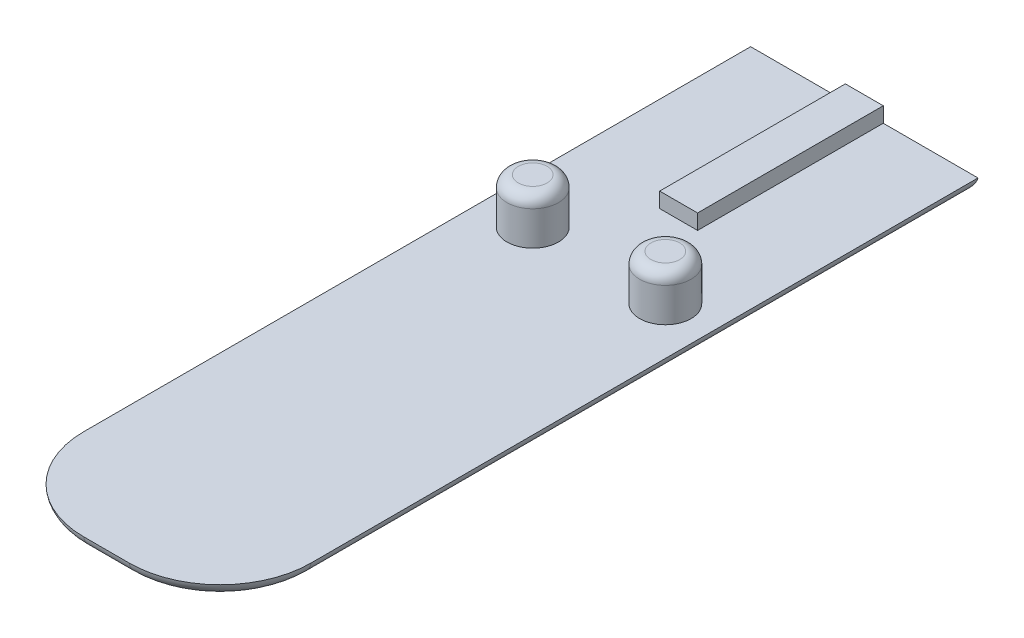
ISO-10303-21;
HEADER;
FILE_DESCRIPTION(('STEP AP214'),'2;1');
FILE_NAME('part.step','',(''),(''),'','','');
FILE_SCHEMA(('AUTOMOTIVE_DESIGN { 1 0 10303 214 1 1 1 1 }'));
ENDSEC;
DATA;
#1=APPLICATION_CONTEXT('core data for automotive mechanical design processes');
#2=APPLICATION_PROTOCOL_DEFINITION('international standard','automotive_design',2000,#1);
#3=PRODUCT_CONTEXT('',#1,'mechanical');
#4=PRODUCT('Part','Part','',(#3));
#5=PRODUCT_RELATED_PRODUCT_CATEGORY('part','',(#4));
#6=PRODUCT_DEFINITION_FORMATION('','',#4);
#7=PRODUCT_DEFINITION_CONTEXT('part definition',#1,'design');
#8=PRODUCT_DEFINITION('design','',#6,#7);
#9=PRODUCT_DEFINITION_SHAPE('','',#8);
#10=(LENGTH_UNIT() NAMED_UNIT(*) SI_UNIT(.MILLI.,.METRE.));
#11=(NAMED_UNIT(*) PLANE_ANGLE_UNIT() SI_UNIT($,.RADIAN.));
#12=(NAMED_UNIT(*) SI_UNIT($,.STERADIAN.) SOLID_ANGLE_UNIT());
#13=UNCERTAINTY_MEASURE_WITH_UNIT(LENGTH_MEASURE(1.E-05),#10,'distance_accuracy_value','');
#14=(GEOMETRIC_REPRESENTATION_CONTEXT(3) GLOBAL_UNCERTAINTY_ASSIGNED_CONTEXT((#13)) GLOBAL_UNIT_ASSIGNED_CONTEXT((#10,
#11,#12)) REPRESENTATION_CONTEXT('',''));
#15=CARTESIAN_POINT('',(0.,0.,0.));
#16=DIRECTION('',(0.,0.,1.));
#17=DIRECTION('',(1.,0.,0.));
#18=AXIS2_PLACEMENT_3D('',#15,#16,#17);
#19=CARTESIAN_POINT('',(0.,1.7,0.));
#20=DIRECTION('',(0.,1.,0.));
#21=DIRECTION('',(0.,0.,1.));
#22=AXIS2_PLACEMENT_3D('',#19,#20,#21);
#23=PLANE('',#22);
#24=CARTESIAN_POINT('',(8.75,1.7,-15.));
#25=DIRECTION('',(0.,1.,0.));
#26=DIRECTION('',(0.,0.,-1.));
#27=AXIS2_PLACEMENT_3D('',#24,#25,#26);
#28=CIRCLE('',#27,3.4);
#29=CARTESIAN_POINT('',(8.75,1.7,-18.4));
#30=VERTEX_POINT('',#29);
#31=EDGE_CURVE('E439',#30,#30,#28,.T.);
#32=ORIENTED_EDGE('',*,*,#31,.F.);
#33=EDGE_LOOP('',(#32));
#34=FACE_BOUND('',#33,.T.);
#35=CARTESIAN_POINT('',(-8.75,1.7,-15.));
#36=DIRECTION('',(0.,1.,0.));
#37=DIRECTION('',(0.,0.,1.));
#38=AXIS2_PLACEMENT_3D('',#35,#36,#37);
#39=CIRCLE('',#38,3.4);
#40=CARTESIAN_POINT('',(-8.75,1.7,-11.6));
#41=VERTEX_POINT('',#40);
#42=EDGE_CURVE('E151',#41,#41,#39,.T.);
#43=ORIENTED_EDGE('',*,*,#42,.F.);
#44=EDGE_LOOP('',(#43));
#45=FACE_BOUND('',#44,.T.);
#46=DIRECTION('',(1.,0.,0.));
#47=VECTOR('',#46,1.);
#48=CARTESIAN_POINT('',(-2.5,1.7,-25.5));
#49=LINE('',#48,#47);
#50=CARTESIAN_POINT('',(-2.5,1.7,-25.5));
#51=VERTEX_POINT('',#50);
#52=CARTESIAN_POINT('',(2.5,1.7,-25.5));
#53=VERTEX_POINT('',#52);
#54=EDGE_CURVE('E150',#51,#53,#49,.T.);
#55=ORIENTED_EDGE('',*,*,#54,.F.);
#56=DIRECTION('',(0.,0.,1.));
#57=VECTOR('',#56,1.);
#58=CARTESIAN_POINT('',(-2.5,1.7,-49.5));
#59=LINE('',#58,#57);
#60=CARTESIAN_POINT('',(-2.5,1.7,-50.));
#61=VERTEX_POINT('',#60);
#62=EDGE_CURVE('E133',#61,#51,#59,.T.);
#63=ORIENTED_EDGE('',*,*,#62,.F.);
#64=DIRECTION('',(1.,0.,0.));
#65=VECTOR('',#64,1.);
#66=CARTESIAN_POINT('',(-15.,1.7,-50.));
#67=LINE('',#66,#65);
#68=CARTESIAN_POINT('',(-15.,1.7,-50.));
#69=VERTEX_POINT('',#68);
#70=EDGE_CURVE('E159',#69,#61,#67,.T.);
#71=ORIENTED_EDGE('',*,*,#70,.F.);
#72=DIRECTION('',(0.,0.,-1.));
#73=VECTOR('',#72,1.);
#74=CARTESIAN_POINT('',(-15.,1.7,50.));
#75=LINE('',#74,#73);
#76=CARTESIAN_POINT('',(-15.,1.7,38.));
#77=VERTEX_POINT('',#76);
#78=EDGE_CURVE('E168',#77,#69,#75,.T.);
#79=ORIENTED_EDGE('',*,*,#78,.F.);
#80=CARTESIAN_POINT('',(-2.99999999999998,1.7,38.));
#81=DIRECTION('',(0.,1.,0.));
#82=DIRECTION('',(0.,0.,1.));
#83=AXIS2_PLACEMENT_3D('',#80,#81,#82);
#84=CIRCLE('',#83,12.);
#85=CARTESIAN_POINT('',(-2.99999999999998,1.7,50.));
#86=VERTEX_POINT('',#85);
#87=EDGE_CURVE('E171',#77,#86,#84,.T.);
#88=ORIENTED_EDGE('',*,*,#87,.T.);
#89=DIRECTION('',(1.,0.,0.));
#90=VECTOR('',#89,1.);
#91=CARTESIAN_POINT('',(-15.,1.7,50.));
#92=LINE('',#91,#90);
#93=CARTESIAN_POINT('',(3.,1.7,50.));
#94=VERTEX_POINT('',#93);
#95=EDGE_CURVE('E166',#86,#94,#92,.T.);
#96=ORIENTED_EDGE('',*,*,#95,.T.);
#97=CARTESIAN_POINT('',(3.,1.7,38.));
#98=DIRECTION('',(0.,1.,0.));
#99=DIRECTION('',(0.,0.,1.));
#100=AXIS2_PLACEMENT_3D('',#97,#98,#99);
#101=CIRCLE('',#100,12.);
#102=CARTESIAN_POINT('',(15.,1.7,38.));
#103=VERTEX_POINT('',#102);
#104=EDGE_CURVE('E173',#94,#103,#101,.T.);
#105=ORIENTED_EDGE('',*,*,#104,.T.);
#106=DIRECTION('',(0.,0.,-1.));
#107=VECTOR('',#106,1.);
#108=CARTESIAN_POINT('',(15.,1.7,50.));
#109=LINE('',#108,#107);
#110=CARTESIAN_POINT('',(15.,1.7,-50.));
#111=VERTEX_POINT('',#110);
#112=EDGE_CURVE('E162',#103,#111,#109,.T.);
#113=ORIENTED_EDGE('',*,*,#112,.T.);
#114=CARTESIAN_POINT('',(2.5,1.7,-50.));
#115=VERTEX_POINT('',#114);
#116=EDGE_CURVE('E163',#115,#111,#67,.T.);
#117=ORIENTED_EDGE('',*,*,#116,.F.);
#118=DIRECTION('',(0.,0.,-1.));
#119=VECTOR('',#118,1.);
#120=CARTESIAN_POINT('',(2.5,1.7,-49.5));
#121=LINE('',#120,#119);
#122=EDGE_CURVE('E153',#53,#115,#121,.T.);
#123=ORIENTED_EDGE('',*,*,#122,.F.);
#124=EDGE_LOOP('',(#55,#63,#71,#79,#88,#96,#105,#113,#117,#123));
#125=FACE_BOUND('',#124,.T.);
#126=ADVANCED_FACE('F39',(#34,#45,#125),#23,.T.);
#127=CARTESIAN_POINT('',(0.,0.,0.));
#128=DIRECTION('',(0.,1.,0.));
#129=DIRECTION('',(0.,0.,1.));
#130=AXIS2_PLACEMENT_3D('',#127,#128,#129);
#131=PLANE('',#130);
#132=DIRECTION('',(0.,0.,-1.));
#133=VECTOR('',#132,1.);
#134=CARTESIAN_POINT('',(-13.0226280066715,0.,0.));
#135=LINE('',#134,#133);
#136=CARTESIAN_POINT('',(-13.0226280066715,0.,38.));
#137=VERTEX_POINT('',#136);
#138=CARTESIAN_POINT('',(-13.0226280066715,0.,-48.0226280066715));
#139=VERTEX_POINT('',#138);
#140=EDGE_CURVE('E62',#137,#139,#135,.T.);
#141=ORIENTED_EDGE('',*,*,#140,.T.);
#142=DIRECTION('',(1.,0.,0.));
#143=VECTOR('',#142,1.);
#144=CARTESIAN_POINT('',(0.,0.,-48.0226280066715));
#145=LINE('',#144,#143);
#146=CARTESIAN_POINT('',(13.0226280066715,0.,-48.0226280066715));
#147=VERTEX_POINT('',#146);
#148=EDGE_CURVE('E184',#139,#147,#145,.T.);
#149=ORIENTED_EDGE('',*,*,#148,.T.);
#150=DIRECTION('',(0.,0.,-1.));
#151=VECTOR('',#150,1.);
#152=CARTESIAN_POINT('',(13.0226280066715,0.,0.));
#153=LINE('',#152,#151);
#154=CARTESIAN_POINT('',(13.0226280066715,0.,38.));
#155=VERTEX_POINT('',#154);
#156=EDGE_CURVE('E175',#147,#155,#153,.F.);
#157=ORIENTED_EDGE('',*,*,#156,.T.);
#158=CARTESIAN_POINT('',(3.,0.,38.));
#159=DIRECTION('',(0.,1.,0.));
#160=DIRECTION('',(0.,0.,1.));
#161=AXIS2_PLACEMENT_3D('',#158,#159,#160);
#162=CIRCLE('',#161,10.0226280066715);
#163=CARTESIAN_POINT('',(3.,0.,48.0226280066715));
#164=VERTEX_POINT('',#163);
#165=EDGE_CURVE('E177',#155,#164,#162,.F.);
#166=ORIENTED_EDGE('',*,*,#165,.T.);
#167=DIRECTION('',(1.,0.,0.));
#168=VECTOR('',#167,1.);
#169=CARTESIAN_POINT('',(0.,0.,48.0226280066715));
#170=LINE('',#169,#168);
#171=CARTESIAN_POINT('',(-2.99999999999998,0.,48.0226280066715));
#172=VERTEX_POINT('',#171);
#173=EDGE_CURVE('E179',#164,#172,#170,.F.);
#174=ORIENTED_EDGE('',*,*,#173,.T.);
#175=CARTESIAN_POINT('',(-2.99999999999998,0.,38.));
#176=DIRECTION('',(0.,1.,0.));
#177=DIRECTION('',(0.,0.,1.));
#178=AXIS2_PLACEMENT_3D('',#175,#176,#177);
#179=CIRCLE('',#178,10.0226280066715);
#180=EDGE_CURVE('E181',#172,#137,#179,.F.);
#181=ORIENTED_EDGE('',*,*,#180,.T.);
#182=EDGE_LOOP('',(#141,#149,#157,#166,#174,#181));
#183=FACE_BOUND('',#182,.T.);
#184=ADVANCED_FACE('F221',(#183),#131,.F.);
#185=CARTESIAN_POINT('',(-15.,2.,48.0226280066715));
#186=DIRECTION('',(1.,0.,0.));
#187=DIRECTION('',(0.,0.,-1.));
#188=AXIS2_PLACEMENT_3D('',#185,#186,#187);
#189=CYLINDRICAL_SURFACE('',#188,2.);
#190=CARTESIAN_POINT('',(3.,2.,48.0226280066714));
#191=DIRECTION('',(1.,0.,0.));
#192=DIRECTION('',(0.,0.,-1.));
#193=AXIS2_PLACEMENT_3D('',#190,#191,#192);
#194=CIRCLE('',#193,2.);
#195=EDGE_CURVE('E196',#94,#164,#194,.T.);
#196=ORIENTED_EDGE('',*,*,#195,.F.);
#197=ORIENTED_EDGE('',*,*,#95,.F.);
#198=CARTESIAN_POINT('',(-2.99999999999998,2.,48.0226280066715));
#199=DIRECTION('',(-1.,0.,0.));
#200=DIRECTION('',(0.,0.,1.));
#201=AXIS2_PLACEMENT_3D('',#198,#199,#200);
#202=CIRCLE('',#201,2.);
#203=EDGE_CURVE('E199',#172,#86,#202,.T.);
#204=ORIENTED_EDGE('',*,*,#203,.F.);
#205=ORIENTED_EDGE('',*,*,#173,.F.);
#206=EDGE_LOOP('',(#196,#197,#204,#205));
#207=FACE_BOUND('',#206,.T.);
#208=ADVANCED_FACE('F227',(#207),#189,.T.);
#209=CARTESIAN_POINT('',(-2.99999999999998,2.,38.));
#210=DIRECTION('',(0.,-1.,0.));
#211=DIRECTION('',(0.,0.,-1.));
#212=AXIS2_PLACEMENT_3D('',#209,#210,#211);
#213=TOROIDAL_SURFACE('',#212,10.0226280066715,2.);
#214=ORIENTED_EDGE('',*,*,#203,.T.);
#215=ORIENTED_EDGE('',*,*,#87,.F.);
#216=CARTESIAN_POINT('',(-13.0226280066715,2.,38.));
#217=DIRECTION('',(0.,0.,-1.));
#218=DIRECTION('',(-1.,0.,0.));
#219=AXIS2_PLACEMENT_3D('',#216,#217,#218);
#220=CIRCLE('',#219,2.);
#221=EDGE_CURVE('E193',#137,#77,#220,.T.);
#222=ORIENTED_EDGE('',*,*,#221,.F.);
#223=ORIENTED_EDGE('',*,*,#180,.F.);
#224=EDGE_LOOP('',(#214,#215,#222,#223));
#225=FACE_BOUND('',#224,.T.);
#226=ADVANCED_FACE('F249',(#225),#213,.T.);
#227=CARTESIAN_POINT('',(3.,2.,38.));
#228=DIRECTION('',(0.,-1.,0.));
#229=DIRECTION('',(0.,0.,-1.));
#230=AXIS2_PLACEMENT_3D('',#227,#228,#229);
#231=TOROIDAL_SURFACE('',#230,10.0226280066715,2.);
#232=ORIENTED_EDGE('',*,*,#195,.T.);
#233=ORIENTED_EDGE('',*,*,#165,.F.);
#234=CARTESIAN_POINT('',(13.0226280066714,2.,38.));
#235=DIRECTION('',(0.,0.,-1.));
#236=DIRECTION('',(-1.,0.,0.));
#237=AXIS2_PLACEMENT_3D('',#234,#235,#236);
#238=CIRCLE('',#237,2.);
#239=EDGE_CURVE('E190',#103,#155,#238,.T.);
#240=ORIENTED_EDGE('',*,*,#239,.F.);
#241=ORIENTED_EDGE('',*,*,#104,.F.);
#242=EDGE_LOOP('',(#232,#233,#240,#241));
#243=FACE_BOUND('',#242,.T.);
#244=ADVANCED_FACE('F245',(#243),#231,.T.);
#245=CARTESIAN_POINT('',(-13.0226280066715,2.,50.));
#246=DIRECTION('',(0.,0.,-1.));
#247=DIRECTION('',(-1.,0.,0.));
#248=AXIS2_PLACEMENT_3D('',#245,#246,#247);
#249=CYLINDRICAL_SURFACE('',#248,2.);
#250=ORIENTED_EDGE('',*,*,#221,.T.);
#251=ORIENTED_EDGE('',*,*,#78,.T.);
#252=CARTESIAN_POINT('',(-13.0226280066715,2.,-48.0226280066715));
#253=DIRECTION('',(0.707106781186547,0.,-0.707106781186548));
#254=DIRECTION('',(-0.707106781186548,0.,-0.707106781186547));
#255=AXIS2_PLACEMENT_3D('',#252,#253,#254);
#256=ELLIPSE('',#255,2.82842712474619,2.);
#257=EDGE_CURVE('E188',#139,#69,#256,.T.);
#258=ORIENTED_EDGE('',*,*,#257,.F.);
#259=ORIENTED_EDGE('',*,*,#140,.F.);
#260=EDGE_LOOP('',(#250,#251,#258,#259));
#261=FACE_BOUND('',#260,.T.);
#262=ADVANCED_FACE('F241',(#261),#249,.T.);
#263=CARTESIAN_POINT('',(13.0226280066715,2.,50.));
#264=DIRECTION('',(0.,0.,-1.));
#265=DIRECTION('',(-1.,0.,0.));
#266=AXIS2_PLACEMENT_3D('',#263,#264,#265);
#267=CYLINDRICAL_SURFACE('',#266,2.);
#268=ORIENTED_EDGE('',*,*,#239,.T.);
#269=ORIENTED_EDGE('',*,*,#156,.F.);
#270=CARTESIAN_POINT('',(13.0226280066715,2.,-48.0226280066715));
#271=DIRECTION('',(-0.707106781186547,0.,-0.707106781186547));
#272=DIRECTION('',(0.707106781186547,0.,-0.707106781186547));
#273=AXIS2_PLACEMENT_3D('',#270,#271,#272);
#274=ELLIPSE('',#273,2.82842712474619,2.);
#275=EDGE_CURVE('E136',#111,#147,#274,.T.);
#276=ORIENTED_EDGE('',*,*,#275,.F.);
#277=ORIENTED_EDGE('',*,*,#112,.F.);
#278=EDGE_LOOP('',(#268,#269,#276,#277));
#279=FACE_BOUND('',#278,.T.);
#280=ADVANCED_FACE('F237',(#279),#267,.T.);
#281=CARTESIAN_POINT('',(-15.,2.,-48.0226280066715));
#282=DIRECTION('',(1.,0.,0.));
#283=DIRECTION('',(0.,0.,-1.));
#284=AXIS2_PLACEMENT_3D('',#281,#282,#283);
#285=CYLINDRICAL_SURFACE('',#284,2.);
#286=ORIENTED_EDGE('',*,*,#257,.T.);
#287=ORIENTED_EDGE('',*,*,#70,.T.);
#288=DIRECTION('',(-1.,0.,0.));
#289=VECTOR('',#288,1.);
#290=CARTESIAN_POINT('',(-2.5,1.7,-50.));
#291=LINE('',#290,#289);
#292=EDGE_CURVE('E127',#115,#61,#291,.T.);
#293=ORIENTED_EDGE('',*,*,#292,.F.);
#294=ORIENTED_EDGE('',*,*,#116,.T.);
#295=ORIENTED_EDGE('',*,*,#275,.T.);
#296=ORIENTED_EDGE('',*,*,#148,.F.);
#297=EDGE_LOOP('',(#286,#287,#293,#294,#295,#296));
#298=FACE_BOUND('',#297,.T.);
#299=ADVANCED_FACE('F234',(#298),#285,.T.);
#300=CARTESIAN_POINT('',(-2.5,3.7,-49.5));
#301=DIRECTION('',(1.,0.,0.));
#302=DIRECTION('',(0.,0.,-1.));
#303=AXIS2_PLACEMENT_3D('',#300,#301,#302);
#304=PLANE('',#303);
#305=ORIENTED_EDGE('',*,*,#62,.T.);
#306=DIRECTION('',(0.,-1.,0.));
#307=VECTOR('',#306,1.);
#308=CARTESIAN_POINT('',(-2.5,3.7,-25.5));
#309=LINE('',#308,#307);
#310=CARTESIAN_POINT('',(-2.5,3.7,-25.5));
#311=VERTEX_POINT('',#310);
#312=EDGE_CURVE('E130',#311,#51,#309,.T.);
#313=ORIENTED_EDGE('',*,*,#312,.F.);
#314=DIRECTION('',(0.,0.,1.));
#315=VECTOR('',#314,1.);
#316=CARTESIAN_POINT('',(-2.5,3.7,-49.5));
#317=LINE('',#316,#315);
#318=CARTESIAN_POINT('',(-2.5,3.7,-50.));
#319=VERTEX_POINT('',#318);
#320=EDGE_CURVE('E117',#319,#311,#317,.T.);
#321=ORIENTED_EDGE('',*,*,#320,.F.);
#322=DIRECTION('',(0.,-1.,0.));
#323=VECTOR('',#322,1.);
#324=CARTESIAN_POINT('',(-2.5,3.7,-50.));
#325=LINE('',#324,#323);
#326=EDGE_CURVE('E148',#319,#61,#325,.T.);
#327=ORIENTED_EDGE('',*,*,#326,.T.);
#328=EDGE_LOOP('',(#305,#313,#321,#327));
#329=FACE_BOUND('',#328,.T.);
#330=ADVANCED_FACE('F131',(#329),#304,.F.);
#331=CARTESIAN_POINT('',(-2.5,3.7,-25.5));
#332=DIRECTION('',(0.,0.,-1.));
#333=DIRECTION('',(-1.,0.,0.));
#334=AXIS2_PLACEMENT_3D('',#331,#332,#333);
#335=PLANE('',#334);
#336=ORIENTED_EDGE('',*,*,#54,.T.);
#337=DIRECTION('',(0.,-1.,0.));
#338=VECTOR('',#337,1.);
#339=CARTESIAN_POINT('',(2.5,3.7,-25.5));
#340=LINE('',#339,#338);
#341=CARTESIAN_POINT('',(2.5,3.7,-25.5));
#342=VERTEX_POINT('',#341);
#343=EDGE_CURVE('E137',#342,#53,#340,.T.);
#344=ORIENTED_EDGE('',*,*,#343,.F.);
#345=DIRECTION('',(1.,0.,0.));
#346=VECTOR('',#345,1.);
#347=CARTESIAN_POINT('',(-2.5,3.7,-25.5));
#348=LINE('',#347,#346);
#349=EDGE_CURVE('E121',#311,#342,#348,.T.);
#350=ORIENTED_EDGE('',*,*,#349,.F.);
#351=ORIENTED_EDGE('',*,*,#312,.T.);
#352=EDGE_LOOP('',(#336,#344,#350,#351));
#353=FACE_BOUND('',#352,.T.);
#354=ADVANCED_FACE('F139',(#353),#335,.F.);
#355=CARTESIAN_POINT('',(2.5,3.7,-49.5));
#356=DIRECTION('',(-1.,0.,0.));
#357=DIRECTION('',(0.,0.,1.));
#358=AXIS2_PLACEMENT_3D('',#355,#356,#357);
#359=PLANE('',#358);
#360=ORIENTED_EDGE('',*,*,#122,.T.);
#361=DIRECTION('',(0.,-1.,0.));
#362=VECTOR('',#361,1.);
#363=CARTESIAN_POINT('',(2.5,3.7,-50.));
#364=LINE('',#363,#362);
#365=CARTESIAN_POINT('',(2.5,3.7,-50.));
#366=VERTEX_POINT('',#365);
#367=EDGE_CURVE('E54',#366,#115,#364,.T.);
#368=ORIENTED_EDGE('',*,*,#367,.F.);
#369=DIRECTION('',(0.,0.,-1.));
#370=VECTOR('',#369,1.);
#371=CARTESIAN_POINT('',(2.5,3.7,-25.5));
#372=LINE('',#371,#370);
#373=EDGE_CURVE('E142',#342,#366,#372,.T.);
#374=ORIENTED_EDGE('',*,*,#373,.F.);
#375=ORIENTED_EDGE('',*,*,#343,.T.);
#376=EDGE_LOOP('',(#360,#368,#374,#375));
#377=FACE_BOUND('',#376,.T.);
#378=ADVANCED_FACE('F278',(#377),#359,.F.);
#379=CARTESIAN_POINT('',(-2.5,3.7,-50.));
#380=DIRECTION('',(0.,0.,1.));
#381=DIRECTION('',(1.,0.,0.));
#382=AXIS2_PLACEMENT_3D('',#379,#380,#381);
#383=PLANE('',#382);
#384=ORIENTED_EDGE('',*,*,#292,.T.);
#385=ORIENTED_EDGE('',*,*,#326,.F.);
#386=DIRECTION('',(-1.,0.,0.));
#387=VECTOR('',#386,1.);
#388=CARTESIAN_POINT('',(-2.5,3.7,-50.));
#389=LINE('',#388,#387);
#390=EDGE_CURVE('E123',#366,#319,#389,.T.);
#391=ORIENTED_EDGE('',*,*,#390,.F.);
#392=ORIENTED_EDGE('',*,*,#367,.T.);
#393=EDGE_LOOP('',(#384,#385,#391,#392));
#394=FACE_BOUND('',#393,.T.);
#395=ADVANCED_FACE('F279',(#394),#383,.F.);
#396=CARTESIAN_POINT('',(0.,3.7,0.));
#397=DIRECTION('',(0.,-1.,0.));
#398=DIRECTION('',(0.,0.,-1.));
#399=AXIS2_PLACEMENT_3D('',#396,#397,#398);
#400=PLANE('',#399);
#401=ORIENTED_EDGE('',*,*,#320,.T.);
#402=ORIENTED_EDGE('',*,*,#349,.T.);
#403=ORIENTED_EDGE('',*,*,#373,.T.);
#404=ORIENTED_EDGE('',*,*,#390,.T.);
#405=EDGE_LOOP('',(#401,#402,#403,#404));
#406=FACE_BOUND('',#405,.T.);
#407=ADVANCED_FACE('F119',(#406),#400,.F.);
#408=CARTESIAN_POINT('',(-8.75,7.7,-15.));
#409=DIRECTION('',(0.,-1.,0.));
#410=DIRECTION('',(0.,0.,-1.));
#411=AXIS2_PLACEMENT_3D('',#408,#409,#410);
#412=CYLINDRICAL_SURFACE('',#411,3.4);
#413=CARTESIAN_POINT('',(-8.75,6.2,-15.));
#414=DIRECTION('',(0.,1.,0.));
#415=DIRECTION('',(0.,0.,1.));
#416=AXIS2_PLACEMENT_3D('',#413,#414,#415);
#417=CIRCLE('',#416,3.4);
#418=CARTESIAN_POINT('',(-8.75,6.2,-11.6));
#419=VERTEX_POINT('',#418);
#420=EDGE_CURVE('E11',#419,#419,#417,.F.);
#421=ORIENTED_EDGE('',*,*,#420,.T.);
#422=EDGE_LOOP('',(#421));
#423=FACE_BOUND('',#422,.T.);
#424=ORIENTED_EDGE('',*,*,#42,.T.);
#425=EDGE_LOOP('',(#424));
#426=FACE_BOUND('',#425,.T.);
#427=ADVANCED_FACE('F286',(#423,#426),#412,.T.);
#428=CARTESIAN_POINT('',(-8.75,7.7,-15.));
#429=DIRECTION('',(0.,1.,0.));
#430=DIRECTION('',(0.,0.,1.));
#431=AXIS2_PLACEMENT_3D('',#428,#429,#430);
#432=PLANE('',#431);
#433=CARTESIAN_POINT('',(-8.75,7.7,-15.));
#434=DIRECTION('',(0.,1.,0.));
#435=DIRECTION('',(0.,0.,1.));
#436=AXIS2_PLACEMENT_3D('',#433,#434,#435);
#437=CIRCLE('',#436,1.9);
#438=CARTESIAN_POINT('',(-8.75,7.7,-13.1));
#439=VERTEX_POINT('',#438);
#440=EDGE_CURVE('E47',#439,#439,#437,.T.);
#441=ORIENTED_EDGE('',*,*,#440,.T.);
#442=EDGE_LOOP('',(#441));
#443=FACE_BOUND('',#442,.T.);
#444=ADVANCED_FACE('F209',(#443),#432,.T.);
#445=CARTESIAN_POINT('',(8.75,7.7,-15.));
#446=DIRECTION('',(0.,-1.,0.));
#447=DIRECTION('',(0.,0.,-1.));
#448=AXIS2_PLACEMENT_3D('',#445,#446,#447);
#449=CYLINDRICAL_SURFACE('',#448,3.4);
#450=CARTESIAN_POINT('',(8.75,6.2,-15.));
#451=DIRECTION('',(0.,-1.,0.));
#452=DIRECTION('',(0.,0.,-1.));
#453=AXIS2_PLACEMENT_3D('',#450,#451,#452);
#454=CIRCLE('',#453,3.4);
#455=CARTESIAN_POINT('',(8.75,6.2,-18.4));
#456=VERTEX_POINT('',#455);
#457=EDGE_CURVE('E204',#456,#456,#454,.T.);
#458=ORIENTED_EDGE('',*,*,#457,.T.);
#459=EDGE_LOOP('',(#458));
#460=FACE_BOUND('',#459,.T.);
#461=ORIENTED_EDGE('',*,*,#31,.T.);
#462=EDGE_LOOP('',(#461));
#463=FACE_BOUND('',#462,.T.);
#464=ADVANCED_FACE('F348',(#460,#463),#449,.T.);
#465=CARTESIAN_POINT('',(8.75,7.7,-15.));
#466=DIRECTION('',(0.,-1.,0.));
#467=DIRECTION('',(0.,0.,-1.));
#468=AXIS2_PLACEMENT_3D('',#465,#466,#467);
#469=PLANE('',#468);
#470=CARTESIAN_POINT('',(8.75,7.7,-15.));
#471=DIRECTION('',(0.,-1.,0.));
#472=DIRECTION('',(0.,0.,-1.));
#473=AXIS2_PLACEMENT_3D('',#470,#471,#472);
#474=CIRCLE('',#473,1.9);
#475=CARTESIAN_POINT('',(8.75,7.7,-16.9));
#476=VERTEX_POINT('',#475);
#477=EDGE_CURVE('E186',#476,#476,#474,.F.);
#478=ORIENTED_EDGE('',*,*,#477,.T.);
#479=EDGE_LOOP('',(#478));
#480=FACE_BOUND('',#479,.T.);
#481=ADVANCED_FACE('F217',(#480),#469,.F.);
#482=CARTESIAN_POINT('',(8.75,6.2,-15.));
#483=DIRECTION('',(0.,-1.,0.));
#484=DIRECTION('',(0.,0.,-1.));
#485=AXIS2_PLACEMENT_3D('',#482,#483,#484);
#486=TOROIDAL_SURFACE('',#485,1.9,1.5);
#487=ORIENTED_EDGE('',*,*,#457,.F.);
#488=EDGE_LOOP('',(#487));
#489=FACE_BOUND('',#488,.T.);
#490=ORIENTED_EDGE('',*,*,#477,.F.);
#491=EDGE_LOOP('',(#490));
#492=FACE_BOUND('',#491,.T.);
#493=ADVANCED_FACE('F212',(#489,#492),#486,.T.);
#494=CARTESIAN_POINT('',(-8.75,6.2,-15.));
#495=DIRECTION('',(0.,1.,0.));
#496=DIRECTION('',(0.,0.,1.));
#497=AXIS2_PLACEMENT_3D('',#494,#495,#496);
#498=TOROIDAL_SURFACE('',#497,1.9,1.5);
#499=ORIENTED_EDGE('',*,*,#420,.F.);
#500=EDGE_LOOP('',(#499));
#501=FACE_BOUND('',#500,.T.);
#502=ORIENTED_EDGE('',*,*,#440,.F.);
#503=EDGE_LOOP('',(#502));
#504=FACE_BOUND('',#503,.T.);
#505=ADVANCED_FACE('F41',(#501,#504),#498,.T.);
#506=CLOSED_SHELL('',(#126,#184,#208,#226,#244,#262,#280,#299,#330,#354,#378,#395,#407,#427,
#444,#464,#481,#493,#505));
#507=MANIFOLD_SOLID_BREP('B2',#506);
#508=ADVANCED_BREP_SHAPE_REPRESENTATION('',(#18,#507),#14);
#509=SHAPE_DEFINITION_REPRESENTATION(#9,#508);
ENDSEC;
END-ISO-10303-21;
